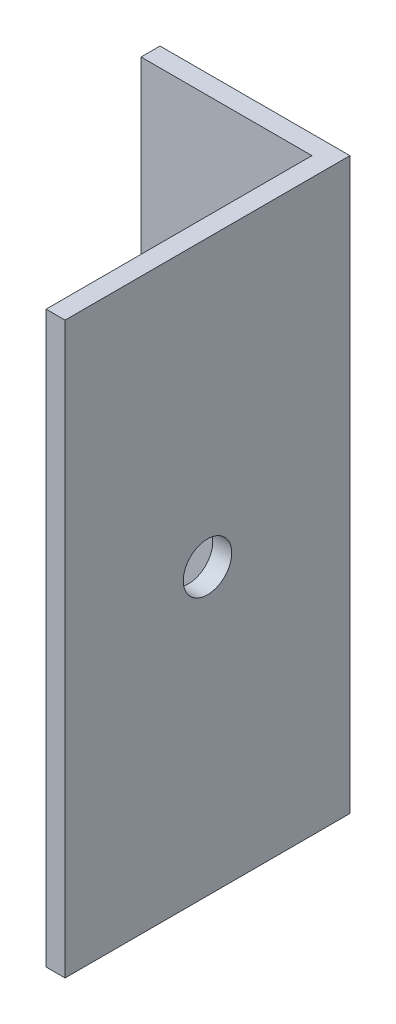
ISO-10303-21;
HEADER;
FILE_DESCRIPTION(('STEP AP214'),'2;1');
FILE_NAME('part.step','',(''),(''),'','','');
FILE_SCHEMA(('AUTOMOTIVE_DESIGN { 1 0 10303 214 1 1 1 1 }'));
ENDSEC;
DATA;
#1=APPLICATION_CONTEXT('core data for automotive mechanical design processes');
#2=APPLICATION_PROTOCOL_DEFINITION('international standard','automotive_design',2000,#1);
#3=PRODUCT_CONTEXT('',#1,'mechanical');
#4=PRODUCT('Part','Part','',(#3));
#5=PRODUCT_RELATED_PRODUCT_CATEGORY('part','',(#4));
#6=PRODUCT_DEFINITION_FORMATION('','',#4);
#7=PRODUCT_DEFINITION_CONTEXT('part definition',#1,'design');
#8=PRODUCT_DEFINITION('design','',#6,#7);
#9=PRODUCT_DEFINITION_SHAPE('','',#8);
#10=(LENGTH_UNIT() NAMED_UNIT(*) SI_UNIT(.MILLI.,.METRE.));
#11=(NAMED_UNIT(*) PLANE_ANGLE_UNIT() SI_UNIT($,.RADIAN.));
#12=(NAMED_UNIT(*) SI_UNIT($,.STERADIAN.) SOLID_ANGLE_UNIT());
#13=UNCERTAINTY_MEASURE_WITH_UNIT(LENGTH_MEASURE(1.E-05),#10,'distance_accuracy_value','');
#14=(GEOMETRIC_REPRESENTATION_CONTEXT(3) GLOBAL_UNCERTAINTY_ASSIGNED_CONTEXT((#13)) GLOBAL_UNIT_ASSIGNED_CONTEXT((#10,
#11,#12)) REPRESENTATION_CONTEXT('',''));
#15=CARTESIAN_POINT('',(0.,0.,0.));
#16=DIRECTION('',(0.,0.,1.));
#17=DIRECTION('',(1.,0.,0.));
#18=AXIS2_PLACEMENT_3D('',#15,#16,#17);
#19=CARTESIAN_POINT('',(-9.23616620757708,60.,2.));
#20=DIRECTION('',(1.,0.,0.));
#21=DIRECTION('',(0.,0.,-1.));
#22=AXIS2_PLACEMENT_3D('',#19,#20,#21);
#23=PLANE('',#22);
#24=DIRECTION('',(0.,0.,1.));
#25=VECTOR('',#24,1.);
#26=CARTESIAN_POINT('',(-9.23616620757708,0.,2.));
#27=LINE('',#26,#25);
#28=CARTESIAN_POINT('',(-9.23616620757708,0.,0.));
#29=VERTEX_POINT('',#28);
#30=CARTESIAN_POINT('',(-9.23616620757708,0.,2.));
#31=VERTEX_POINT('',#30);
#32=EDGE_CURVE('E128',#29,#31,#27,.T.);
#33=ORIENTED_EDGE('',*,*,#32,.T.);
#34=DIRECTION('',(0.,-1.,0.));
#35=VECTOR('',#34,1.);
#36=CARTESIAN_POINT('',(-9.23616620757708,60.,2.));
#37=LINE('',#36,#35);
#38=CARTESIAN_POINT('',(-9.23616620757708,60.,2.));
#39=VERTEX_POINT('',#38);
#40=EDGE_CURVE('E11',#39,#31,#37,.T.);
#41=ORIENTED_EDGE('',*,*,#40,.F.);
#42=DIRECTION('',(0.,0.,1.));
#43=VECTOR('',#42,1.);
#44=CARTESIAN_POINT('',(-9.23616620757708,60.,2.));
#45=LINE('',#44,#43);
#46=CARTESIAN_POINT('',(-9.23616620757708,60.,0.));
#47=VERTEX_POINT('',#46);
#48=EDGE_CURVE('E145',#47,#39,#45,.T.);
#49=ORIENTED_EDGE('',*,*,#48,.F.);
#50=DIRECTION('',(0.,-1.,0.));
#51=VECTOR('',#50,1.);
#52=CARTESIAN_POINT('',(-9.23616620757708,60.,0.));
#53=LINE('',#52,#51);
#54=EDGE_CURVE('E124',#47,#29,#53,.T.);
#55=ORIENTED_EDGE('',*,*,#54,.T.);
#56=EDGE_LOOP('',(#33,#41,#49,#55));
#57=FACE_BOUND('',#56,.T.);
#58=ADVANCED_FACE('F39',(#57),#23,.F.);
#59=CARTESIAN_POINT('',(8.76383379242293,60.,2.));
#60=DIRECTION('',(0.,0.,-1.));
#61=DIRECTION('',(-1.,0.,0.));
#62=AXIS2_PLACEMENT_3D('',#59,#60,#61);
#63=PLANE('',#62);
#64=DIRECTION('',(1.,0.,0.));
#65=VECTOR('',#64,1.);
#66=CARTESIAN_POINT('',(8.76383379242293,0.,2.));
#67=LINE('',#66,#65);
#68=CARTESIAN_POINT('',(8.76383379242293,0.,2.));
#69=VERTEX_POINT('',#68);
#70=EDGE_CURVE('E132',#31,#69,#67,.T.);
#71=ORIENTED_EDGE('',*,*,#70,.T.);
#72=DIRECTION('',(0.,-1.,0.));
#73=VECTOR('',#72,1.);
#74=CARTESIAN_POINT('',(8.76383379242293,60.,2.));
#75=LINE('',#74,#73);
#76=CARTESIAN_POINT('',(8.76383379242293,60.,2.));
#77=VERTEX_POINT('',#76);
#78=EDGE_CURVE('E48',#77,#69,#75,.T.);
#79=ORIENTED_EDGE('',*,*,#78,.F.);
#80=DIRECTION('',(1.,0.,0.));
#81=VECTOR('',#80,1.);
#82=CARTESIAN_POINT('',(8.76383379242293,60.,2.));
#83=LINE('',#82,#81);
#84=EDGE_CURVE('E93',#39,#77,#83,.T.);
#85=ORIENTED_EDGE('',*,*,#84,.F.);
#86=ORIENTED_EDGE('',*,*,#40,.T.);
#87=EDGE_LOOP('',(#71,#79,#85,#86));
#88=FACE_BOUND('',#87,.T.);
#89=ADVANCED_FACE('F174',(#88),#63,.F.);
#90=CARTESIAN_POINT('',(8.76383379242293,60.,30.));
#91=DIRECTION('',(1.,0.,0.));
#92=DIRECTION('',(0.,0.,-1.));
#93=AXIS2_PLACEMENT_3D('',#90,#91,#92);
#94=PLANE('',#93);
#95=CARTESIAN_POINT('',(8.76383379242292,30.,15.));
#96=DIRECTION('',(1.,0.,0.));
#97=DIRECTION('',(0.,0.,-1.));
#98=AXIS2_PLACEMENT_3D('',#95,#96,#97);
#99=CIRCLE('',#98,2.55);
#100=CARTESIAN_POINT('',(8.76383379242292,30.,12.45));
#101=VERTEX_POINT('',#100);
#102=EDGE_CURVE('E133',#101,#101,#99,.T.);
#103=ORIENTED_EDGE('',*,*,#102,.T.);
#104=EDGE_LOOP('',(#103));
#105=FACE_BOUND('',#104,.T.);
#106=DIRECTION('',(0.,0.,1.));
#107=VECTOR('',#106,1.);
#108=CARTESIAN_POINT('',(8.76383379242293,0.,30.));
#109=LINE('',#108,#107);
#110=CARTESIAN_POINT('',(8.76383379242293,0.,30.));
#111=VERTEX_POINT('',#110);
#112=EDGE_CURVE('E136',#69,#111,#109,.T.);
#113=ORIENTED_EDGE('',*,*,#112,.T.);
#114=DIRECTION('',(0.,-1.,0.));
#115=VECTOR('',#114,1.);
#116=CARTESIAN_POINT('',(8.76383379242293,60.,30.));
#117=LINE('',#116,#115);
#118=CARTESIAN_POINT('',(8.76383379242293,60.,30.));
#119=VERTEX_POINT('',#118);
#120=EDGE_CURVE('E117',#119,#111,#117,.T.);
#121=ORIENTED_EDGE('',*,*,#120,.F.);
#122=DIRECTION('',(0.,0.,1.));
#123=VECTOR('',#122,1.);
#124=CARTESIAN_POINT('',(8.76383379242293,60.,30.));
#125=LINE('',#124,#123);
#126=EDGE_CURVE('E106',#77,#119,#125,.T.);
#127=ORIENTED_EDGE('',*,*,#126,.F.);
#128=ORIENTED_EDGE('',*,*,#78,.T.);
#129=EDGE_LOOP('',(#113,#121,#127,#128));
#130=FACE_BOUND('',#129,.T.);
#131=ADVANCED_FACE('F155',(#105,#130),#94,.F.);
#132=CARTESIAN_POINT('',(10.7638337924229,60.,30.));
#133=DIRECTION('',(0.,0.,-1.));
#134=DIRECTION('',(-1.,0.,0.));
#135=AXIS2_PLACEMENT_3D('',#132,#133,#134);
#136=PLANE('',#135);
#137=DIRECTION('',(1.,0.,0.));
#138=VECTOR('',#137,1.);
#139=CARTESIAN_POINT('',(10.7638337924229,0.,30.));
#140=LINE('',#139,#138);
#141=CARTESIAN_POINT('',(10.7638337924229,0.,30.));
#142=VERTEX_POINT('',#141);
#143=EDGE_CURVE('E115',#111,#142,#140,.T.);
#144=ORIENTED_EDGE('',*,*,#143,.T.);
#145=DIRECTION('',(0.,-1.,0.));
#146=VECTOR('',#145,1.);
#147=CARTESIAN_POINT('',(10.7638337924229,60.,30.));
#148=LINE('',#147,#146);
#149=CARTESIAN_POINT('',(10.7638337924229,60.,30.));
#150=VERTEX_POINT('',#149);
#151=EDGE_CURVE('E112',#150,#142,#148,.T.);
#152=ORIENTED_EDGE('',*,*,#151,.F.);
#153=DIRECTION('',(1.,0.,0.));
#154=VECTOR('',#153,1.);
#155=CARTESIAN_POINT('',(10.7638337924229,60.,30.));
#156=LINE('',#155,#154);
#157=EDGE_CURVE('E100',#119,#150,#156,.T.);
#158=ORIENTED_EDGE('',*,*,#157,.F.);
#159=ORIENTED_EDGE('',*,*,#120,.T.);
#160=EDGE_LOOP('',(#144,#152,#158,#159));
#161=FACE_BOUND('',#160,.T.);
#162=ADVANCED_FACE('F113',(#161),#136,.F.);
#163=CARTESIAN_POINT('',(10.7638337924229,60.,0.));
#164=DIRECTION('',(-1.,0.,0.));
#165=DIRECTION('',(0.,0.,1.));
#166=AXIS2_PLACEMENT_3D('',#163,#164,#165);
#167=PLANE('',#166);
#168=CARTESIAN_POINT('',(10.7638337924229,30.,15.));
#169=DIRECTION('',(1.,0.,0.));
#170=DIRECTION('',(0.,0.,-1.));
#171=AXIS2_PLACEMENT_3D('',#168,#169,#170);
#172=CIRCLE('',#171,2.55);
#173=CARTESIAN_POINT('',(10.7638337924229,30.,12.45));
#174=VERTEX_POINT('',#173);
#175=EDGE_CURVE('E229',#174,#174,#172,.T.);
#176=ORIENTED_EDGE('',*,*,#175,.F.);
#177=EDGE_LOOP('',(#176));
#178=FACE_BOUND('',#177,.T.);
#179=DIRECTION('',(0.,0.,-1.));
#180=VECTOR('',#179,1.);
#181=CARTESIAN_POINT('',(10.7638337924229,0.,0.));
#182=LINE('',#181,#180);
#183=CARTESIAN_POINT('',(10.7638337924229,0.,0.));
#184=VERTEX_POINT('',#183);
#185=EDGE_CURVE('E79',#142,#184,#182,.T.);
#186=ORIENTED_EDGE('',*,*,#185,.T.);
#187=DIRECTION('',(0.,-1.,0.));
#188=VECTOR('',#187,1.);
#189=CARTESIAN_POINT('',(10.7638337924229,60.,0.));
#190=LINE('',#189,#188);
#191=CARTESIAN_POINT('',(10.7638337924229,60.,0.));
#192=VERTEX_POINT('',#191);
#193=EDGE_CURVE('E118',#192,#184,#190,.T.);
#194=ORIENTED_EDGE('',*,*,#193,.F.);
#195=DIRECTION('',(0.,0.,-1.));
#196=VECTOR('',#195,1.);
#197=CARTESIAN_POINT('',(10.7638337924229,60.,0.));
#198=LINE('',#197,#196);
#199=EDGE_CURVE('E104',#150,#192,#198,.T.);
#200=ORIENTED_EDGE('',*,*,#199,.F.);
#201=ORIENTED_EDGE('',*,*,#151,.T.);
#202=EDGE_LOOP('',(#186,#194,#200,#201));
#203=FACE_BOUND('',#202,.T.);
#204=ADVANCED_FACE('F120',(#178,#203),#167,.F.);
#205=CARTESIAN_POINT('',(-9.23616620757708,60.,0.));
#206=DIRECTION('',(0.,0.,1.));
#207=DIRECTION('',(1.,0.,0.));
#208=AXIS2_PLACEMENT_3D('',#205,#206,#207);
#209=PLANE('',#208);
#210=DIRECTION('',(-1.,0.,0.));
#211=VECTOR('',#210,1.);
#212=CARTESIAN_POINT('',(-9.23616620757708,0.,0.));
#213=LINE('',#212,#211);
#214=EDGE_CURVE('E85',#184,#29,#213,.T.);
#215=ORIENTED_EDGE('',*,*,#214,.T.);
#216=ORIENTED_EDGE('',*,*,#54,.F.);
#217=DIRECTION('',(-1.,0.,0.));
#218=VECTOR('',#217,1.);
#219=CARTESIAN_POINT('',(-9.23616620757708,60.,0.));
#220=LINE('',#219,#218);
#221=EDGE_CURVE('E56',#192,#47,#220,.T.);
#222=ORIENTED_EDGE('',*,*,#221,.F.);
#223=ORIENTED_EDGE('',*,*,#193,.T.);
#224=EDGE_LOOP('',(#215,#216,#222,#223));
#225=FACE_BOUND('',#224,.T.);
#226=ADVANCED_FACE('F162',(#225),#209,.F.);
#227=CARTESIAN_POINT('',(0.,60.,0.));
#228=DIRECTION('',(0.,-1.,0.));
#229=DIRECTION('',(0.,0.,-1.));
#230=AXIS2_PLACEMENT_3D('',#227,#228,#229);
#231=PLANE('',#230);
#232=ORIENTED_EDGE('',*,*,#48,.T.);
#233=ORIENTED_EDGE('',*,*,#84,.T.);
#234=ORIENTED_EDGE('',*,*,#126,.T.);
#235=ORIENTED_EDGE('',*,*,#157,.T.);
#236=ORIENTED_EDGE('',*,*,#199,.T.);
#237=ORIENTED_EDGE('',*,*,#221,.T.);
#238=EDGE_LOOP('',(#232,#233,#234,#235,#236,#237));
#239=FACE_BOUND('',#238,.T.);
#240=ADVANCED_FACE('F102',(#239),#231,.F.);
#241=CARTESIAN_POINT('',(0.,0.,0.));
#242=DIRECTION('',(0.,-1.,0.));
#243=DIRECTION('',(0.,0.,-1.));
#244=AXIS2_PLACEMENT_3D('',#241,#242,#243);
#245=PLANE('',#244);
#246=ORIENTED_EDGE('',*,*,#32,.F.);
#247=ORIENTED_EDGE('',*,*,#214,.F.);
#248=ORIENTED_EDGE('',*,*,#185,.F.);
#249=ORIENTED_EDGE('',*,*,#143,.F.);
#250=ORIENTED_EDGE('',*,*,#112,.F.);
#251=ORIENTED_EDGE('',*,*,#70,.F.);
#252=EDGE_LOOP('',(#246,#247,#248,#249,#250,#251));
#253=FACE_BOUND('',#252,.T.);
#254=ADVANCED_FACE('F158',(#253),#245,.T.);
#255=CARTESIAN_POINT('',(-49.2361662075771,30.,15.));
#256=DIRECTION('',(1.,0.,0.));
#257=DIRECTION('',(0.,0.,-1.));
#258=AXIS2_PLACEMENT_3D('',#255,#256,#257);
#259=CYLINDRICAL_SURFACE('',#258,2.55);
#260=ORIENTED_EDGE('',*,*,#175,.T.);
#261=EDGE_LOOP('',(#260));
#262=FACE_BOUND('',#261,.T.);
#263=ORIENTED_EDGE('',*,*,#102,.F.);
#264=EDGE_LOOP('',(#263));
#265=FACE_BOUND('',#264,.T.);
#266=ADVANCED_FACE('F202',(#262,#265),#259,.F.);
#267=CLOSED_SHELL('',(#58,#89,#131,#162,#204,#226,#240,#254,#266));
#268=MANIFOLD_SOLID_BREP('B2',#267);
#269=ADVANCED_BREP_SHAPE_REPRESENTATION('',(#18,#268),#14);
#270=SHAPE_DEFINITION_REPRESENTATION(#9,#269);
ENDSEC;
END-ISO-10303-21;
